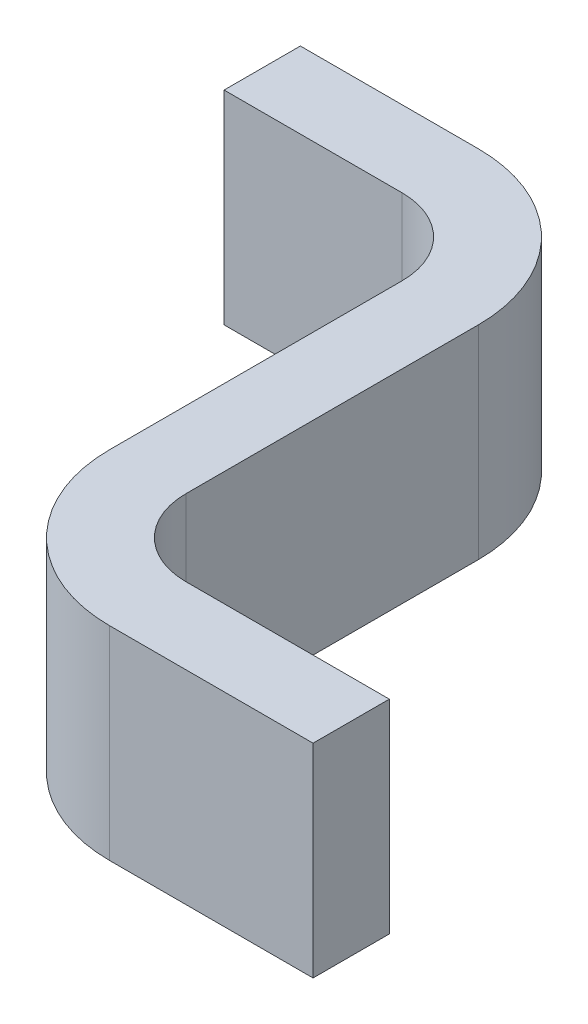
ISO-10303-21;
HEADER;
FILE_DESCRIPTION(('STEP AP214'),'2;1');
FILE_NAME('part.step','',(''),(''),'','','');
FILE_SCHEMA(('AUTOMOTIVE_DESIGN { 1 0 10303 214 1 1 1 1 }'));
ENDSEC;
DATA;
#1=APPLICATION_CONTEXT('core data for automotive mechanical design processes');
#2=APPLICATION_PROTOCOL_DEFINITION('international standard','automotive_design',2000,#1);
#3=PRODUCT_CONTEXT('',#1,'mechanical');
#4=PRODUCT('Part','Part','',(#3));
#5=PRODUCT_RELATED_PRODUCT_CATEGORY('part','',(#4));
#6=PRODUCT_DEFINITION_FORMATION('','',#4);
#7=PRODUCT_DEFINITION_CONTEXT('part definition',#1,'design');
#8=PRODUCT_DEFINITION('design','',#6,#7);
#9=PRODUCT_DEFINITION_SHAPE('','',#8);
#10=(LENGTH_UNIT() NAMED_UNIT(*) SI_UNIT(.MILLI.,.METRE.));
#11=(NAMED_UNIT(*) PLANE_ANGLE_UNIT() SI_UNIT($,.RADIAN.));
#12=(NAMED_UNIT(*) SI_UNIT($,.STERADIAN.) SOLID_ANGLE_UNIT());
#13=UNCERTAINTY_MEASURE_WITH_UNIT(LENGTH_MEASURE(1.E-05),#10,'distance_accuracy_value','');
#14=(GEOMETRIC_REPRESENTATION_CONTEXT(3) GLOBAL_UNCERTAINTY_ASSIGNED_CONTEXT((#13)) GLOBAL_UNIT_ASSIGNED_CONTEXT((#10,
#11,#12)) REPRESENTATION_CONTEXT('',''));
#15=CARTESIAN_POINT('',(0.,0.,0.));
#16=DIRECTION('',(0.,0.,1.));
#17=DIRECTION('',(1.,0.,0.));
#18=AXIS2_PLACEMENT_3D('',#15,#16,#17);
#19=CARTESIAN_POINT('',(-3.15,1.47,0.));
#20=DIRECTION('',(0.,1.,0.));
#21=DIRECTION('',(1.,0.,0.));
#22=AXIS2_PLACEMENT_3D('',#19,#20,#21);
#23=PLANE('',#22);
#24=DIRECTION('',(0.,0.,1.));
#25=VECTOR('',#24,1.);
#26=CARTESIAN_POINT('',(-2.75,1.47,1.175));
#27=LINE('',#26,#25);
#28=CARTESIAN_POINT('',(-2.75,1.47,0.3));
#29=VERTEX_POINT('',#28);
#30=CARTESIAN_POINT('',(-2.75,1.47,0.875));
#31=VERTEX_POINT('',#30);
#32=EDGE_CURVE('E11',#29,#31,#27,.T.);
#33=ORIENTED_EDGE('',*,*,#32,.F.);
#34=CARTESIAN_POINT('',(-3.05,1.47,0.3));
#35=DIRECTION('',(0.,-1.,0.));
#36=DIRECTION('',(0.,0.,1.));
#37=AXIS2_PLACEMENT_3D('',#34,#35,#36);
#38=CIRCLE('',#37,0.3);
#39=CARTESIAN_POINT('',(-3.05,1.47,0.));
#40=VERTEX_POINT('',#39);
#41=EDGE_CURVE('E160',#40,#29,#38,.T.);
#42=ORIENTED_EDGE('',*,*,#41,.F.);
#43=DIRECTION('',(-1.,0.,0.));
#44=VECTOR('',#43,1.);
#45=CARTESIAN_POINT('',(0.,1.47,0.));
#46=LINE('',#45,#44);
#47=CARTESIAN_POINT('',(-3.4,1.47,0.));
#48=VERTEX_POINT('',#47);
#49=EDGE_CURVE('E20',#40,#48,#46,.T.);
#50=ORIENTED_EDGE('',*,*,#49,.T.);
#51=DIRECTION('',(0.,0.,-1.));
#52=VECTOR('',#51,1.);
#53=CARTESIAN_POINT('',(-3.4,1.47,0.));
#54=LINE('',#53,#52);
#55=CARTESIAN_POINT('',(-3.4,1.47,0.15));
#56=VERTEX_POINT('',#55);
#57=EDGE_CURVE('E146',#56,#48,#54,.T.);
#58=ORIENTED_EDGE('',*,*,#57,.F.);
#59=DIRECTION('',(-1.,0.,0.));
#60=VECTOR('',#59,1.);
#61=CARTESIAN_POINT('',(0.,1.47,0.15));
#62=LINE('',#61,#60);
#63=CARTESIAN_POINT('',(-3.05,1.47,0.15));
#64=VERTEX_POINT('',#63);
#65=EDGE_CURVE('E238',#64,#56,#62,.T.);
#66=ORIENTED_EDGE('',*,*,#65,.F.);
#67=CARTESIAN_POINT('',(-3.05,1.47,0.3));
#68=DIRECTION('',(0.,-1.,0.));
#69=DIRECTION('',(0.,0.,1.));
#70=AXIS2_PLACEMENT_3D('',#67,#68,#69);
#71=CIRCLE('',#70,0.15);
#72=CARTESIAN_POINT('',(-2.9,1.47,0.3));
#73=VERTEX_POINT('',#72);
#74=EDGE_CURVE('E242',#64,#73,#71,.T.);
#75=ORIENTED_EDGE('',*,*,#74,.T.);
#76=DIRECTION('',(0.,0.,-1.));
#77=VECTOR('',#76,1.);
#78=CARTESIAN_POINT('',(-2.9,1.47,1.175));
#79=LINE('',#78,#77);
#80=CARTESIAN_POINT('',(-2.9,1.47,0.875));
#81=VERTEX_POINT('',#80);
#82=EDGE_CURVE('E192',#81,#73,#79,.T.);
#83=ORIENTED_EDGE('',*,*,#82,.F.);
#84=CARTESIAN_POINT('',(-2.6,1.47,0.875));
#85=DIRECTION('',(0.,-1.,0.));
#86=DIRECTION('',(0.,0.,-1.));
#87=AXIS2_PLACEMENT_3D('',#84,#85,#86);
#88=CIRCLE('',#87,0.3);
#89=CARTESIAN_POINT('',(-2.6,1.47,1.175));
#90=VERTEX_POINT('',#89);
#91=EDGE_CURVE('E212',#90,#81,#88,.T.);
#92=ORIENTED_EDGE('',*,*,#91,.F.);
#93=DIRECTION('',(-1.,0.,0.));
#94=VECTOR('',#93,1.);
#95=CARTESIAN_POINT('',(0.,1.47,1.175));
#96=LINE('',#95,#94);
#97=CARTESIAN_POINT('',(-2.2,1.47,1.175));
#98=VERTEX_POINT('',#97);
#99=EDGE_CURVE('E122',#98,#90,#96,.T.);
#100=ORIENTED_EDGE('',*,*,#99,.F.);
#101=DIRECTION('',(0.,0.,1.));
#102=VECTOR('',#101,1.);
#103=CARTESIAN_POINT('',(-2.2,1.47,1.1));
#104=LINE('',#103,#102);
#105=CARTESIAN_POINT('',(-2.2,1.47,1.025));
#106=VERTEX_POINT('',#105);
#107=EDGE_CURVE('E117',#106,#98,#104,.T.);
#108=ORIENTED_EDGE('',*,*,#107,.F.);
#109=DIRECTION('',(-1.,0.,0.));
#110=VECTOR('',#109,1.);
#111=CARTESIAN_POINT('',(0.,1.47,1.025));
#112=LINE('',#111,#110);
#113=CARTESIAN_POINT('',(-2.6,1.47,1.025));
#114=VERTEX_POINT('',#113);
#115=EDGE_CURVE('E108',#106,#114,#112,.T.);
#116=ORIENTED_EDGE('',*,*,#115,.T.);
#117=CARTESIAN_POINT('',(-2.6,1.47,0.875));
#118=DIRECTION('',(0.,-1.,0.));
#119=DIRECTION('',(0.,0.,1.));
#120=AXIS2_PLACEMENT_3D('',#117,#118,#119);
#121=CIRCLE('',#120,0.15);
#122=EDGE_CURVE('E145',#114,#31,#121,.T.);
#123=ORIENTED_EDGE('',*,*,#122,.T.);
#124=EDGE_LOOP('',(#33,#42,#50,#58,#66,#75,#83,#92,#100,#108,#116,#123));
#125=FACE_BOUND('',#124,.T.);
#126=ADVANCED_FACE('F16',(#125),#23,.T.);
#127=CARTESIAN_POINT('',(-2.75,1.27,1.175));
#128=DIRECTION('',(1.,0.,0.));
#129=DIRECTION('',(0.,1.,0.));
#130=AXIS2_PLACEMENT_3D('',#127,#128,#129);
#131=PLANE('',#130);
#132=DIRECTION('',(0.,-1.,0.));
#133=VECTOR('',#132,1.);
#134=CARTESIAN_POINT('',(-2.75,0.635,0.875));
#135=LINE('',#134,#133);
#136=CARTESIAN_POINT('',(-2.75,1.07,0.875));
#137=VERTEX_POINT('',#136);
#138=EDGE_CURVE('E27',#31,#137,#135,.T.);
#139=ORIENTED_EDGE('',*,*,#138,.T.);
#140=DIRECTION('',(0.,0.,1.));
#141=VECTOR('',#140,1.);
#142=CARTESIAN_POINT('',(-2.75,1.07,1.1));
#143=LINE('',#142,#141);
#144=CARTESIAN_POINT('',(-2.75,1.07,0.3));
#145=VERTEX_POINT('',#144);
#146=EDGE_CURVE('E202',#145,#137,#143,.T.);
#147=ORIENTED_EDGE('',*,*,#146,.F.);
#148=DIRECTION('',(0.,1.,0.));
#149=VECTOR('',#148,1.);
#150=CARTESIAN_POINT('',(-2.75,1.27,0.3));
#151=LINE('',#150,#149);
#152=EDGE_CURVE('E156',#145,#29,#151,.T.);
#153=ORIENTED_EDGE('',*,*,#152,.T.);
#154=ORIENTED_EDGE('',*,*,#32,.T.);
#155=EDGE_LOOP('',(#139,#147,#153,#154));
#156=FACE_BOUND('',#155,.T.);
#157=ADVANCED_FACE('F428',(#156),#131,.T.);
#158=CARTESIAN_POINT('',(-2.6,0.635,0.875));
#159=DIRECTION('',(0.,1.,0.));
#160=DIRECTION('',(0.,0.,1.));
#161=AXIS2_PLACEMENT_3D('',#158,#159,#160);
#162=CYLINDRICAL_SURFACE('',#161,0.15);
#163=ORIENTED_EDGE('',*,*,#122,.F.);
#164=DIRECTION('',(0.,-1.,0.));
#165=VECTOR('',#164,1.);
#166=CARTESIAN_POINT('',(-2.6,0.,1.025));
#167=LINE('',#166,#165);
#168=CARTESIAN_POINT('',(-2.6,1.07,1.025));
#169=VERTEX_POINT('',#168);
#170=EDGE_CURVE('E59',#114,#169,#167,.T.);
#171=ORIENTED_EDGE('',*,*,#170,.T.);
#172=CARTESIAN_POINT('',(-2.6,1.07,0.875));
#173=DIRECTION('',(0.,1.,0.));
#174=DIRECTION('',(0.,0.,1.));
#175=AXIS2_PLACEMENT_3D('',#172,#173,#174);
#176=CIRCLE('',#175,0.15);
#177=EDGE_CURVE('E155',#137,#169,#176,.T.);
#178=ORIENTED_EDGE('',*,*,#177,.F.);
#179=ORIENTED_EDGE('',*,*,#138,.F.);
#180=EDGE_LOOP('',(#163,#171,#178,#179));
#181=FACE_BOUND('',#180,.T.);
#182=ADVANCED_FACE('F432',(#181),#162,.F.);
#183=CARTESIAN_POINT('',(0.,0.,1.025));
#184=DIRECTION('',(0.,0.,1.));
#185=DIRECTION('',(1.,0.,0.));
#186=AXIS2_PLACEMENT_3D('',#183,#184,#185);
#187=PLANE('',#186);
#188=ORIENTED_EDGE('',*,*,#115,.F.);
#189=DIRECTION('',(0.,1.,0.));
#190=VECTOR('',#189,1.);
#191=CARTESIAN_POINT('',(-2.2,1.27,1.025));
#192=LINE('',#191,#190);
#193=CARTESIAN_POINT('',(-2.2,1.07,1.025));
#194=VERTEX_POINT('',#193);
#195=EDGE_CURVE('E112',#194,#106,#192,.T.);
#196=ORIENTED_EDGE('',*,*,#195,.F.);
#197=DIRECTION('',(1.,0.,0.));
#198=VECTOR('',#197,1.);
#199=CARTESIAN_POINT('',(-2.475,1.07,1.025));
#200=LINE('',#199,#198);
#201=EDGE_CURVE('E152',#169,#194,#200,.T.);
#202=ORIENTED_EDGE('',*,*,#201,.F.);
#203=ORIENTED_EDGE('',*,*,#170,.F.);
#204=EDGE_LOOP('',(#188,#196,#202,#203));
#205=FACE_BOUND('',#204,.T.);
#206=ADVANCED_FACE('F110',(#205),#187,.F.);
#207=CARTESIAN_POINT('',(-2.2,1.27,1.1));
#208=DIRECTION('',(1.,0.,0.));
#209=DIRECTION('',(0.,1.,0.));
#210=AXIS2_PLACEMENT_3D('',#207,#208,#209);
#211=PLANE('',#210);
#212=DIRECTION('',(0.,1.,0.));
#213=VECTOR('',#212,1.);
#214=CARTESIAN_POINT('',(-2.2,0.,1.175));
#215=LINE('',#214,#213);
#216=CARTESIAN_POINT('',(-2.2,1.07,1.175));
#217=VERTEX_POINT('',#216);
#218=EDGE_CURVE('E138',#217,#98,#215,.T.);
#219=ORIENTED_EDGE('',*,*,#218,.F.);
#220=DIRECTION('',(0.,0.,1.));
#221=VECTOR('',#220,1.);
#222=CARTESIAN_POINT('',(-2.2,1.07,1.1));
#223=LINE('',#222,#221);
#224=EDGE_CURVE('E129',#194,#217,#223,.T.);
#225=ORIENTED_EDGE('',*,*,#224,.F.);
#226=ORIENTED_EDGE('',*,*,#195,.T.);
#227=ORIENTED_EDGE('',*,*,#107,.T.);
#228=EDGE_LOOP('',(#219,#225,#226,#227));
#229=FACE_BOUND('',#228,.T.);
#230=ADVANCED_FACE('F127',(#229),#211,.T.);
#231=CARTESIAN_POINT('',(0.,0.,1.175));
#232=DIRECTION('',(0.,0.,1.));
#233=DIRECTION('',(1.,0.,0.));
#234=AXIS2_PLACEMENT_3D('',#231,#232,#233);
#235=PLANE('',#234);
#236=ORIENTED_EDGE('',*,*,#218,.T.);
#237=ORIENTED_EDGE('',*,*,#99,.T.);
#238=DIRECTION('',(0.,1.,0.));
#239=VECTOR('',#238,1.);
#240=CARTESIAN_POINT('',(-2.6,0.635,1.175));
#241=LINE('',#240,#239);
#242=CARTESIAN_POINT('',(-2.6,1.07,1.175));
#243=VERTEX_POINT('',#242);
#244=EDGE_CURVE('E195',#243,#90,#241,.T.);
#245=ORIENTED_EDGE('',*,*,#244,.F.);
#246=DIRECTION('',(-1.,0.,0.));
#247=VECTOR('',#246,1.);
#248=CARTESIAN_POINT('',(-2.475,1.07,1.175));
#249=LINE('',#248,#247);
#250=EDGE_CURVE('E167',#217,#243,#249,.T.);
#251=ORIENTED_EDGE('',*,*,#250,.F.);
#252=EDGE_LOOP('',(#236,#237,#245,#251));
#253=FACE_BOUND('',#252,.T.);
#254=ADVANCED_FACE('F303',(#253),#235,.T.);
#255=CARTESIAN_POINT('',(-2.6,0.635,0.875));
#256=DIRECTION('',(0.,-1.,0.));
#257=DIRECTION('',(0.,0.,-1.));
#258=AXIS2_PLACEMENT_3D('',#255,#256,#257);
#259=CYLINDRICAL_SURFACE('',#258,0.3);
#260=DIRECTION('',(0.,1.,0.));
#261=VECTOR('',#260,1.);
#262=CARTESIAN_POINT('',(-2.9,1.27,0.875));
#263=LINE('',#262,#261);
#264=CARTESIAN_POINT('',(-2.9,1.07,0.875));
#265=VERTEX_POINT('',#264);
#266=EDGE_CURVE('E196',#265,#81,#263,.T.);
#267=ORIENTED_EDGE('',*,*,#266,.F.);
#268=CARTESIAN_POINT('',(-2.6,1.07,0.875));
#269=DIRECTION('',(0.,-1.,0.));
#270=DIRECTION('',(0.,0.,-1.));
#271=AXIS2_PLACEMENT_3D('',#268,#269,#270);
#272=CIRCLE('',#271,0.3);
#273=EDGE_CURVE('E163',#243,#265,#272,.T.);
#274=ORIENTED_EDGE('',*,*,#273,.F.);
#275=ORIENTED_EDGE('',*,*,#244,.T.);
#276=ORIENTED_EDGE('',*,*,#91,.T.);
#277=EDGE_LOOP('',(#267,#274,#275,#276));
#278=FACE_BOUND('',#277,.T.);
#279=ADVANCED_FACE('F278',(#278),#259,.T.);
#280=CARTESIAN_POINT('',(-2.9,1.27,1.175));
#281=DIRECTION('',(-1.,0.,0.));
#282=DIRECTION('',(0.,0.,1.));
#283=AXIS2_PLACEMENT_3D('',#280,#281,#282);
#284=PLANE('',#283);
#285=ORIENTED_EDGE('',*,*,#266,.T.);
#286=ORIENTED_EDGE('',*,*,#82,.T.);
#287=DIRECTION('',(0.,-1.,0.));
#288=VECTOR('',#287,1.);
#289=CARTESIAN_POINT('',(-2.9,0.635,0.3));
#290=LINE('',#289,#288);
#291=CARTESIAN_POINT('',(-2.9,1.07,0.3));
#292=VERTEX_POINT('',#291);
#293=EDGE_CURVE('E142',#73,#292,#290,.T.);
#294=ORIENTED_EDGE('',*,*,#293,.T.);
#295=DIRECTION('',(0.,0.,-1.));
#296=VECTOR('',#295,1.);
#297=CARTESIAN_POINT('',(-2.9,1.07,1.1));
#298=LINE('',#297,#296);
#299=EDGE_CURVE('E166',#265,#292,#298,.T.);
#300=ORIENTED_EDGE('',*,*,#299,.F.);
#301=EDGE_LOOP('',(#285,#286,#294,#300));
#302=FACE_BOUND('',#301,.T.);
#303=ADVANCED_FACE('F263',(#302),#284,.T.);
#304=CARTESIAN_POINT('',(-3.05,0.635,0.3));
#305=DIRECTION('',(0.,1.,0.));
#306=DIRECTION('',(0.,0.,1.));
#307=AXIS2_PLACEMENT_3D('',#304,#305,#306);
#308=CYLINDRICAL_SURFACE('',#307,0.15);
#309=ORIENTED_EDGE('',*,*,#74,.F.);
#310=DIRECTION('',(0.,1.,0.));
#311=VECTOR('',#310,1.);
#312=CARTESIAN_POINT('',(-3.05,0.,0.15));
#313=LINE('',#312,#311);
#314=CARTESIAN_POINT('',(-3.05,1.07,0.15));
#315=VERTEX_POINT('',#314);
#316=EDGE_CURVE('E150',#315,#64,#313,.T.);
#317=ORIENTED_EDGE('',*,*,#316,.F.);
#318=CARTESIAN_POINT('',(-3.05,1.07,0.3));
#319=DIRECTION('',(0.,1.,0.));
#320=DIRECTION('',(0.,0.,1.));
#321=AXIS2_PLACEMENT_3D('',#318,#319,#320);
#322=CIRCLE('',#321,0.15);
#323=EDGE_CURVE('E208',#292,#315,#322,.T.);
#324=ORIENTED_EDGE('',*,*,#323,.F.);
#325=ORIENTED_EDGE('',*,*,#293,.F.);
#326=EDGE_LOOP('',(#309,#317,#324,#325));
#327=FACE_BOUND('',#326,.T.);
#328=ADVANCED_FACE('F269',(#327),#308,.F.);
#329=CARTESIAN_POINT('',(0.,0.,0.15));
#330=DIRECTION('',(0.,0.,1.));
#331=DIRECTION('',(1.,0.,0.));
#332=AXIS2_PLACEMENT_3D('',#329,#330,#331);
#333=PLANE('',#332);
#334=DIRECTION('',(0.,1.,0.));
#335=VECTOR('',#334,1.);
#336=CARTESIAN_POINT('',(-3.4,1.27,0.15));
#337=LINE('',#336,#335);
#338=CARTESIAN_POINT('',(-3.4,1.07,0.15));
#339=VERTEX_POINT('',#338);
#340=EDGE_CURVE('E151',#339,#56,#337,.T.);
#341=ORIENTED_EDGE('',*,*,#340,.F.);
#342=DIRECTION('',(-1.,0.,0.));
#343=VECTOR('',#342,1.);
#344=CARTESIAN_POINT('',(-2.475,1.07,0.15));
#345=LINE('',#344,#343);
#346=EDGE_CURVE('E188',#315,#339,#345,.T.);
#347=ORIENTED_EDGE('',*,*,#346,.F.);
#348=ORIENTED_EDGE('',*,*,#316,.T.);
#349=ORIENTED_EDGE('',*,*,#65,.T.);
#350=EDGE_LOOP('',(#341,#347,#348,#349));
#351=FACE_BOUND('',#350,.T.);
#352=ADVANCED_FACE('F308',(#351),#333,.T.);
#353=CARTESIAN_POINT('',(-3.4,1.27,0.));
#354=DIRECTION('',(-1.,0.,0.));
#355=DIRECTION('',(0.,0.,1.));
#356=AXIS2_PLACEMENT_3D('',#353,#354,#355);
#357=PLANE('',#356);
#358=DIRECTION('',(0.,-1.,0.));
#359=VECTOR('',#358,1.);
#360=CARTESIAN_POINT('',(-3.4,0.,0.));
#361=LINE('',#360,#359);
#362=CARTESIAN_POINT('',(-3.4,1.07,0.));
#363=VERTEX_POINT('',#362);
#364=EDGE_CURVE('E159',#48,#363,#361,.T.);
#365=ORIENTED_EDGE('',*,*,#364,.T.);
#366=DIRECTION('',(0.,0.,-1.));
#367=VECTOR('',#366,1.);
#368=CARTESIAN_POINT('',(-3.4,1.07,1.1));
#369=LINE('',#368,#367);
#370=EDGE_CURVE('E178',#339,#363,#369,.T.);
#371=ORIENTED_EDGE('',*,*,#370,.F.);
#372=ORIENTED_EDGE('',*,*,#340,.T.);
#373=ORIENTED_EDGE('',*,*,#57,.T.);
#374=EDGE_LOOP('',(#365,#371,#372,#373));
#375=FACE_BOUND('',#374,.T.);
#376=ADVANCED_FACE('F450',(#375),#357,.T.);
#377=CARTESIAN_POINT('',(0.,0.,0.));
#378=DIRECTION('',(0.,0.,1.));
#379=DIRECTION('',(1.,0.,0.));
#380=AXIS2_PLACEMENT_3D('',#377,#378,#379);
#381=PLANE('',#380);
#382=DIRECTION('',(1.,0.,0.));
#383=VECTOR('',#382,1.);
#384=CARTESIAN_POINT('',(-2.475,1.07,0.));
#385=LINE('',#384,#383);
#386=CARTESIAN_POINT('',(-3.05,1.07,0.));
#387=VERTEX_POINT('',#386);
#388=EDGE_CURVE('E222',#363,#387,#385,.T.);
#389=ORIENTED_EDGE('',*,*,#388,.F.);
#390=ORIENTED_EDGE('',*,*,#364,.F.);
#391=ORIENTED_EDGE('',*,*,#49,.F.);
#392=DIRECTION('',(0.,1.,0.));
#393=VECTOR('',#392,1.);
#394=CARTESIAN_POINT('',(-3.05,0.635,0.));
#395=LINE('',#394,#393);
#396=EDGE_CURVE('E170',#387,#40,#395,.T.);
#397=ORIENTED_EDGE('',*,*,#396,.F.);
#398=EDGE_LOOP('',(#389,#390,#391,#397));
#399=FACE_BOUND('',#398,.T.);
#400=ADVANCED_FACE('F419',(#399),#381,.F.);
#401=CARTESIAN_POINT('',(-3.05,0.635,0.3));
#402=DIRECTION('',(0.,1.,0.));
#403=DIRECTION('',(0.,0.,1.));
#404=AXIS2_PLACEMENT_3D('',#401,#402,#403);
#405=CYLINDRICAL_SURFACE('',#404,0.3);
#406=ORIENTED_EDGE('',*,*,#396,.T.);
#407=ORIENTED_EDGE('',*,*,#41,.T.);
#408=ORIENTED_EDGE('',*,*,#152,.F.);
#409=CARTESIAN_POINT('',(-3.05,1.07,0.3));
#410=DIRECTION('',(0.,-1.,0.));
#411=DIRECTION('',(0.,0.,1.));
#412=AXIS2_PLACEMENT_3D('',#409,#410,#411);
#413=CIRCLE('',#412,0.3);
#414=EDGE_CURVE('E218',#387,#145,#413,.T.);
#415=ORIENTED_EDGE('',*,*,#414,.F.);
#416=EDGE_LOOP('',(#406,#407,#408,#415));
#417=FACE_BOUND('',#416,.T.);
#418=ADVANCED_FACE('F414',(#417),#405,.T.);
#419=CARTESIAN_POINT('',(-2.475,1.07,1.1));
#420=DIRECTION('',(0.,-1.,0.));
#421=DIRECTION('',(0.,0.,-1.));
#422=AXIS2_PLACEMENT_3D('',#419,#420,#421);
#423=PLANE('',#422);
#424=ORIENTED_EDGE('',*,*,#388,.T.);
#425=ORIENTED_EDGE('',*,*,#414,.T.);
#426=ORIENTED_EDGE('',*,*,#146,.T.);
#427=ORIENTED_EDGE('',*,*,#177,.T.);
#428=ORIENTED_EDGE('',*,*,#201,.T.);
#429=ORIENTED_EDGE('',*,*,#224,.T.);
#430=ORIENTED_EDGE('',*,*,#250,.T.);
#431=ORIENTED_EDGE('',*,*,#273,.T.);
#432=ORIENTED_EDGE('',*,*,#299,.T.);
#433=ORIENTED_EDGE('',*,*,#323,.T.);
#434=ORIENTED_EDGE('',*,*,#346,.T.);
#435=ORIENTED_EDGE('',*,*,#370,.T.);
#436=EDGE_LOOP('',(#424,#425,#426,#427,#428,#429,#430,#431,#432,#433,#434,#435));
#437=FACE_BOUND('',#436,.T.);
#438=ADVANCED_FACE('F18',(#437),#423,.T.);
#439=CLOSED_SHELL('',(#126,#157,#182,#206,#230,#254,#279,#303,#328,#352,#376,#400,#418,#438));
#440=MANIFOLD_SOLID_BREP('B1',#439);
#441=ADVANCED_BREP_SHAPE_REPRESENTATION('',(#18,#440),#14);
#442=SHAPE_DEFINITION_REPRESENTATION(#9,#441);
ENDSEC;
END-ISO-10303-21;
